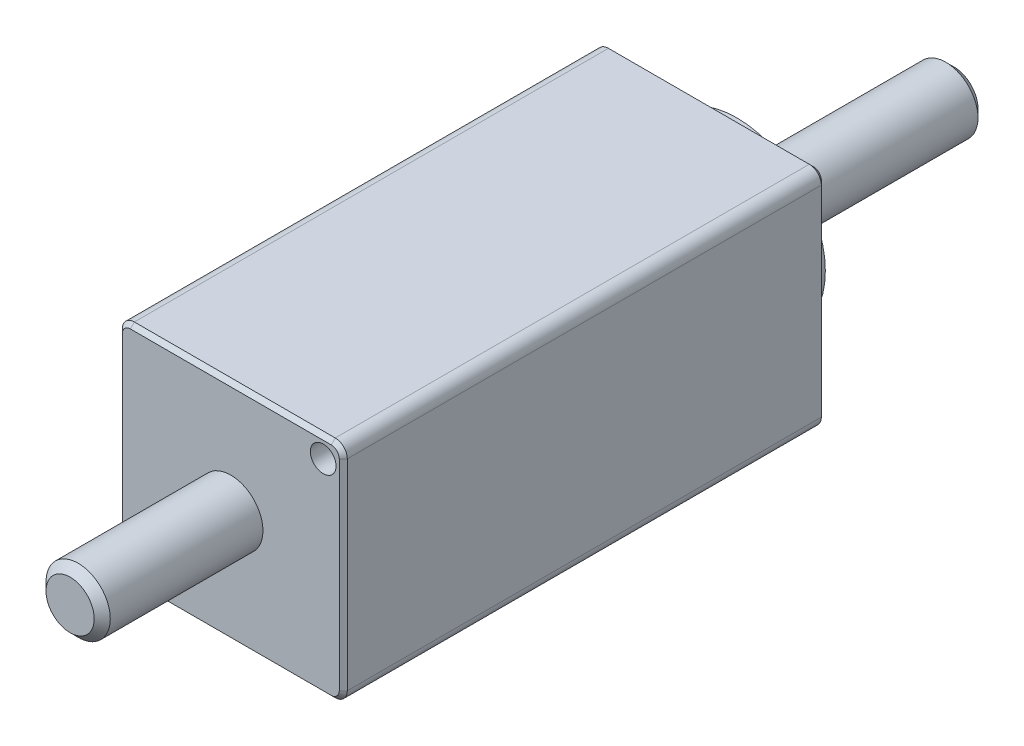
ISO-10303-21;
HEADER;
FILE_DESCRIPTION(('STEP AP214'),'2;1');
FILE_NAME('part.step','',(''),(''),'','','');
FILE_SCHEMA(('AUTOMOTIVE_DESIGN { 1 0 10303 214 1 1 1 1 }'));
ENDSEC;
DATA;
#1=APPLICATION_CONTEXT('core data for automotive mechanical design processes');
#2=APPLICATION_PROTOCOL_DEFINITION('international standard','automotive_design',2000,#1);
#3=PRODUCT_CONTEXT('',#1,'mechanical');
#4=PRODUCT('Part','Part','',(#3));
#5=PRODUCT_RELATED_PRODUCT_CATEGORY('part','',(#4));
#6=PRODUCT_DEFINITION_FORMATION('','',#4);
#7=PRODUCT_DEFINITION_CONTEXT('part definition',#1,'design');
#8=PRODUCT_DEFINITION('design','',#6,#7);
#9=PRODUCT_DEFINITION_SHAPE('','',#8);
#10=(LENGTH_UNIT() NAMED_UNIT(*) SI_UNIT(.MILLI.,.METRE.));
#11=(NAMED_UNIT(*) PLANE_ANGLE_UNIT() SI_UNIT($,.RADIAN.));
#12=(NAMED_UNIT(*) SI_UNIT($,.STERADIAN.) SOLID_ANGLE_UNIT());
#13=UNCERTAINTY_MEASURE_WITH_UNIT(LENGTH_MEASURE(1.E-05),#10,'distance_accuracy_value','');
#14=(GEOMETRIC_REPRESENTATION_CONTEXT(3) GLOBAL_UNCERTAINTY_ASSIGNED_CONTEXT((#13)) GLOBAL_UNIT_ASSIGNED_CONTEXT((#10,
#11,#12)) REPRESENTATION_CONTEXT('',''));
#15=CARTESIAN_POINT('',(0.,0.,0.));
#16=DIRECTION('',(0.,0.,1.));
#17=DIRECTION('',(1.,0.,0.));
#18=AXIS2_PLACEMENT_3D('',#15,#16,#17);
#19=CARTESIAN_POINT('',(7.,7.,30.));
#20=DIRECTION('',(-1.,0.,0.));
#21=DIRECTION('',(0.,-1.,0.));
#22=AXIS2_PLACEMENT_3D('',#19,#20,#21);
#23=PLANE('',#22);
#24=DIRECTION('',(0.,0.,-1.));
#25=VECTOR('',#24,1.);
#26=CARTESIAN_POINT('',(7.,6.25,30.));
#27=LINE('',#26,#25);
#28=CARTESIAN_POINT('',(7.,6.25,0.25));
#29=VERTEX_POINT('',#28);
#30=CARTESIAN_POINT('',(7.,6.25,29.75));
#31=VERTEX_POINT('',#30);
#32=EDGE_CURVE('E250',#29,#31,#27,.F.);
#33=ORIENTED_EDGE('',*,*,#32,.T.);
#34=DIRECTION('',(0.,-1.,0.));
#35=VECTOR('',#34,1.);
#36=CARTESIAN_POINT('',(7.,-6.25,29.75));
#37=LINE('',#36,#35);
#38=CARTESIAN_POINT('',(7.,-6.25,29.75));
#39=VERTEX_POINT('',#38);
#40=EDGE_CURVE('E285',#31,#39,#37,.T.);
#41=ORIENTED_EDGE('',*,*,#40,.T.);
#42=DIRECTION('',(0.,0.,-1.));
#43=VECTOR('',#42,1.);
#44=CARTESIAN_POINT('',(7.,-6.25,30.));
#45=LINE('',#44,#43);
#46=CARTESIAN_POINT('',(7.,-6.25,0.25));
#47=VERTEX_POINT('',#46);
#48=EDGE_CURVE('E247',#39,#47,#45,.T.);
#49=ORIENTED_EDGE('',*,*,#48,.T.);
#50=DIRECTION('',(0.,1.,0.));
#51=VECTOR('',#50,1.);
#52=CARTESIAN_POINT('',(7.,7.,0.25));
#53=LINE('',#52,#51);
#54=EDGE_CURVE('E282',#47,#29,#53,.T.);
#55=ORIENTED_EDGE('',*,*,#54,.T.);
#56=EDGE_LOOP('',(#33,#41,#49,#55));
#57=FACE_BOUND('',#56,.T.);
#58=ADVANCED_FACE('F39',(#57),#23,.F.);
#59=CARTESIAN_POINT('',(-7.,7.,30.));
#60=DIRECTION('',(0.,-1.,0.));
#61=DIRECTION('',(0.,0.,-1.));
#62=AXIS2_PLACEMENT_3D('',#59,#60,#61);
#63=PLANE('',#62);
#64=DIRECTION('',(0.,0.,-1.));
#65=VECTOR('',#64,1.);
#66=CARTESIAN_POINT('',(-6.25,7.,30.));
#67=LINE('',#66,#65);
#68=CARTESIAN_POINT('',(-6.25,7.,0.25));
#69=VERTEX_POINT('',#68);
#70=CARTESIAN_POINT('',(-6.25,7.,29.75));
#71=VERTEX_POINT('',#70);
#72=EDGE_CURVE('E241',#69,#71,#67,.F.);
#73=ORIENTED_EDGE('',*,*,#72,.T.);
#74=DIRECTION('',(1.,0.,0.));
#75=VECTOR('',#74,1.);
#76=CARTESIAN_POINT('',(6.25,7.,29.75));
#77=LINE('',#76,#75);
#78=CARTESIAN_POINT('',(6.25,7.,29.75));
#79=VERTEX_POINT('',#78);
#80=EDGE_CURVE('E298',#71,#79,#77,.T.);
#81=ORIENTED_EDGE('',*,*,#80,.T.);
#82=DIRECTION('',(0.,0.,-1.));
#83=VECTOR('',#82,1.);
#84=CARTESIAN_POINT('',(6.25,7.,30.));
#85=LINE('',#84,#83);
#86=CARTESIAN_POINT('',(6.25,7.,0.25));
#87=VERTEX_POINT('',#86);
#88=EDGE_CURVE('E244',#79,#87,#85,.T.);
#89=ORIENTED_EDGE('',*,*,#88,.T.);
#90=DIRECTION('',(-1.,0.,0.));
#91=VECTOR('',#90,1.);
#92=CARTESIAN_POINT('',(-7.,7.,0.25));
#93=LINE('',#92,#91);
#94=EDGE_CURVE('E296',#87,#69,#93,.T.);
#95=ORIENTED_EDGE('',*,*,#94,.T.);
#96=EDGE_LOOP('',(#73,#81,#89,#95));
#97=FACE_BOUND('',#96,.T.);
#98=ADVANCED_FACE('F450',(#97),#63,.F.);
#99=CARTESIAN_POINT('',(-7.,7.,30.));
#100=DIRECTION('',(1.,0.,0.));
#101=DIRECTION('',(0.,1.,0.));
#102=AXIS2_PLACEMENT_3D('',#99,#100,#101);
#103=PLANE('',#102);
#104=DIRECTION('',(0.,0.,-1.));
#105=VECTOR('',#104,1.);
#106=CARTESIAN_POINT('',(-7.,-6.25,30.));
#107=LINE('',#106,#105);
#108=CARTESIAN_POINT('',(-7.,-6.25,0.25));
#109=VERTEX_POINT('',#108);
#110=CARTESIAN_POINT('',(-7.,-6.25,29.75));
#111=VERTEX_POINT('',#110);
#112=EDGE_CURVE('E262',#109,#111,#107,.F.);
#113=ORIENTED_EDGE('',*,*,#112,.T.);
#114=DIRECTION('',(0.,1.,0.));
#115=VECTOR('',#114,1.);
#116=CARTESIAN_POINT('',(-7.,6.25,29.75));
#117=LINE('',#116,#115);
#118=CARTESIAN_POINT('',(-7.,6.25,29.75));
#119=VERTEX_POINT('',#118);
#120=EDGE_CURVE('E314',#111,#119,#117,.T.);
#121=ORIENTED_EDGE('',*,*,#120,.T.);
#122=DIRECTION('',(0.,0.,-1.));
#123=VECTOR('',#122,1.);
#124=CARTESIAN_POINT('',(-7.,6.25,30.));
#125=LINE('',#124,#123);
#126=CARTESIAN_POINT('',(-7.,6.25,0.25));
#127=VERTEX_POINT('',#126);
#128=EDGE_CURVE('E259',#119,#127,#125,.T.);
#129=ORIENTED_EDGE('',*,*,#128,.T.);
#130=DIRECTION('',(0.,-1.,0.));
#131=VECTOR('',#130,1.);
#132=CARTESIAN_POINT('',(-7.,7.,0.25));
#133=LINE('',#132,#131);
#134=EDGE_CURVE('E312',#127,#109,#133,.T.);
#135=ORIENTED_EDGE('',*,*,#134,.T.);
#136=EDGE_LOOP('',(#113,#121,#129,#135));
#137=FACE_BOUND('',#136,.T.);
#138=ADVANCED_FACE('F434',(#137),#103,.F.);
#139=CARTESIAN_POINT('',(-7.,-7.,30.));
#140=DIRECTION('',(0.,1.,0.));
#141=DIRECTION('',(0.,0.,1.));
#142=AXIS2_PLACEMENT_3D('',#139,#140,#141);
#143=PLANE('',#142);
#144=DIRECTION('',(0.,0.,-1.));
#145=VECTOR('',#144,1.);
#146=CARTESIAN_POINT('',(6.25,-7.,30.));
#147=LINE('',#146,#145);
#148=CARTESIAN_POINT('',(6.25,-7.,0.25));
#149=VERTEX_POINT('',#148);
#150=CARTESIAN_POINT('',(6.25,-7.,29.75));
#151=VERTEX_POINT('',#150);
#152=EDGE_CURVE('E256',#149,#151,#147,.F.);
#153=ORIENTED_EDGE('',*,*,#152,.T.);
#154=DIRECTION('',(-1.,0.,0.));
#155=VECTOR('',#154,1.);
#156=CARTESIAN_POINT('',(-6.25,-7.,29.75));
#157=LINE('',#156,#155);
#158=CARTESIAN_POINT('',(-6.25,-7.,29.75));
#159=VERTEX_POINT('',#158);
#160=EDGE_CURVE('E302',#151,#159,#157,.T.);
#161=ORIENTED_EDGE('',*,*,#160,.T.);
#162=DIRECTION('',(0.,0.,-1.));
#163=VECTOR('',#162,1.);
#164=CARTESIAN_POINT('',(-6.25,-7.,30.));
#165=LINE('',#164,#163);
#166=CARTESIAN_POINT('',(-6.25,-7.,0.25));
#167=VERTEX_POINT('',#166);
#168=EDGE_CURVE('E253',#159,#167,#165,.T.);
#169=ORIENTED_EDGE('',*,*,#168,.T.);
#170=DIRECTION('',(1.,0.,0.));
#171=VECTOR('',#170,1.);
#172=CARTESIAN_POINT('',(-7.,-7.,0.25));
#173=LINE('',#172,#171);
#174=EDGE_CURVE('E300',#167,#149,#173,.T.);
#175=ORIENTED_EDGE('',*,*,#174,.T.);
#176=EDGE_LOOP('',(#153,#161,#169,#175));
#177=FACE_BOUND('',#176,.T.);
#178=ADVANCED_FACE('F419',(#177),#143,.F.);
#179=CARTESIAN_POINT('',(0.,0.,30.));
#180=DIRECTION('',(0.,0.,1.));
#181=DIRECTION('',(1.,0.,0.));
#182=AXIS2_PLACEMENT_3D('',#179,#180,#181);
#183=PLANE('',#182);
#184=CARTESIAN_POINT('',(5.75,5.75,30.));
#185=DIRECTION('',(0.,0.,1.));
#186=DIRECTION('',(1.,0.,0.));
#187=AXIS2_PLACEMENT_3D('',#184,#185,#186);
#188=CIRCLE('',#187,0.79999999999999);
#189=CARTESIAN_POINT('',(6.54999999999999,5.75,30.));
#190=VERTEX_POINT('',#189);
#191=EDGE_CURVE('E181',#190,#190,#188,.T.);
#192=ORIENTED_EDGE('',*,*,#191,.F.);
#193=EDGE_LOOP('',(#192));
#194=FACE_BOUND('',#193,.T.);
#195=CARTESIAN_POINT('',(-5.75,-5.75,30.));
#196=DIRECTION('',(0.,0.,1.));
#197=DIRECTION('',(1.,0.,0.));
#198=AXIS2_PLACEMENT_3D('',#195,#196,#197);
#199=CIRCLE('',#198,0.79999999999999);
#200=CARTESIAN_POINT('',(-4.95000000000001,-5.75,30.));
#201=VERTEX_POINT('',#200);
#202=EDGE_CURVE('E180',#201,#201,#199,.T.);
#203=ORIENTED_EDGE('',*,*,#202,.F.);
#204=EDGE_LOOP('',(#203));
#205=FACE_BOUND('',#204,.T.);
#206=CARTESIAN_POINT('',(6.25,-6.25,30.));
#207=DIRECTION('',(0.,0.,1.));
#208=DIRECTION('',(1.,0.,0.));
#209=AXIS2_PLACEMENT_3D('',#206,#207,#208);
#210=CIRCLE('',#209,0.5);
#211=CARTESIAN_POINT('',(6.25,-6.75,30.));
#212=VERTEX_POINT('',#211);
#213=CARTESIAN_POINT('',(6.75,-6.25,30.));
#214=VERTEX_POINT('',#213);
#215=EDGE_CURVE('E275',#212,#214,#210,.T.);
#216=ORIENTED_EDGE('',*,*,#215,.T.);
#217=DIRECTION('',(0.,1.,0.));
#218=VECTOR('',#217,1.);
#219=CARTESIAN_POINT('',(6.75,6.25,30.));
#220=LINE('',#219,#218);
#221=CARTESIAN_POINT('',(6.75,6.25,30.));
#222=VERTEX_POINT('',#221);
#223=EDGE_CURVE('E279',#214,#222,#220,.T.);
#224=ORIENTED_EDGE('',*,*,#223,.T.);
#225=CARTESIAN_POINT('',(6.25,6.25,30.));
#226=DIRECTION('',(0.,0.,1.));
#227=DIRECTION('',(1.,0.,0.));
#228=AXIS2_PLACEMENT_3D('',#225,#226,#227);
#229=CIRCLE('',#228,0.5);
#230=CARTESIAN_POINT('',(6.25,6.75,30.));
#231=VERTEX_POINT('',#230);
#232=EDGE_CURVE('E277',#222,#231,#229,.T.);
#233=ORIENTED_EDGE('',*,*,#232,.T.);
#234=DIRECTION('',(-1.,0.,0.));
#235=VECTOR('',#234,1.);
#236=CARTESIAN_POINT('',(-6.25,6.75,30.));
#237=LINE('',#236,#235);
#238=CARTESIAN_POINT('',(-6.25,6.75,30.));
#239=VERTEX_POINT('',#238);
#240=EDGE_CURVE('E273',#231,#239,#237,.T.);
#241=ORIENTED_EDGE('',*,*,#240,.T.);
#242=CARTESIAN_POINT('',(-6.25,6.25,30.));
#243=DIRECTION('',(0.,0.,1.));
#244=DIRECTION('',(1.,0.,0.));
#245=AXIS2_PLACEMENT_3D('',#242,#243,#244);
#246=CIRCLE('',#245,0.5);
#247=CARTESIAN_POINT('',(-6.75,6.25,30.));
#248=VERTEX_POINT('',#247);
#249=EDGE_CURVE('E269',#239,#248,#246,.T.);
#250=ORIENTED_EDGE('',*,*,#249,.T.);
#251=DIRECTION('',(0.,-1.,0.));
#252=VECTOR('',#251,1.);
#253=CARTESIAN_POINT('',(-6.75,-6.25,30.));
#254=LINE('',#253,#252);
#255=CARTESIAN_POINT('',(-6.75,-6.25,30.));
#256=VERTEX_POINT('',#255);
#257=EDGE_CURVE('E265',#248,#256,#254,.T.);
#258=ORIENTED_EDGE('',*,*,#257,.T.);
#259=CARTESIAN_POINT('',(-6.25,-6.25,30.));
#260=DIRECTION('',(0.,0.,1.));
#261=DIRECTION('',(1.,0.,0.));
#262=AXIS2_PLACEMENT_3D('',#259,#260,#261);
#263=CIRCLE('',#262,0.5);
#264=CARTESIAN_POINT('',(-6.25,-6.75,30.));
#265=VERTEX_POINT('',#264);
#266=EDGE_CURVE('E267',#256,#265,#263,.T.);
#267=ORIENTED_EDGE('',*,*,#266,.T.);
#268=DIRECTION('',(1.,0.,0.));
#269=VECTOR('',#268,1.);
#270=CARTESIAN_POINT('',(6.25,-6.75,30.));
#271=LINE('',#270,#269);
#272=EDGE_CURVE('E271',#265,#212,#271,.T.);
#273=ORIENTED_EDGE('',*,*,#272,.T.);
#274=EDGE_LOOP('',(#216,#224,#233,#241,#250,#258,#267,#273));
#275=FACE_BOUND('',#274,.T.);
#276=CARTESIAN_POINT('',(0.,0.,30.));
#277=DIRECTION('',(0.,0.,1.));
#278=DIRECTION('',(1.,0.,0.));
#279=AXIS2_PLACEMENT_3D('',#276,#277,#278);
#280=CIRCLE('',#279,2.);
#281=CARTESIAN_POINT('',(2.,0.,30.));
#282=VERTEX_POINT('',#281);
#283=EDGE_CURVE('E217',#282,#282,#280,.T.);
#284=ORIENTED_EDGE('',*,*,#283,.F.);
#285=EDGE_LOOP('',(#284));
#286=FACE_BOUND('',#285,.T.);
#287=ADVANCED_FACE('F410',(#194,#205,#275,#286),#183,.T.);
#288=CARTESIAN_POINT('',(0.,0.,0.));
#289=DIRECTION('',(0.,0.,1.));
#290=DIRECTION('',(1.,0.,0.));
#291=AXIS2_PLACEMENT_3D('',#288,#289,#290);
#292=PLANE('',#291);
#293=CARTESIAN_POINT('',(6.25,6.25,0.));
#294=DIRECTION('',(0.,0.,1.));
#295=DIRECTION('',(1.,0.,0.));
#296=AXIS2_PLACEMENT_3D('',#293,#294,#295);
#297=CIRCLE('',#296,0.499999999999993);
#298=CARTESIAN_POINT('',(6.25,6.74999999999999,0.));
#299=VERTEX_POINT('',#298);
#300=CARTESIAN_POINT('',(6.74999999999999,6.25,0.));
#301=VERTEX_POINT('',#300);
#302=EDGE_CURVE('E48',#299,#301,#297,.F.);
#303=ORIENTED_EDGE('',*,*,#302,.T.);
#304=DIRECTION('',(0.,-1.,0.));
#305=VECTOR('',#304,1.);
#306=CARTESIAN_POINT('',(6.74999999999999,0.,0.));
#307=LINE('',#306,#305);
#308=CARTESIAN_POINT('',(6.74999999999999,-6.25,0.));
#309=VERTEX_POINT('',#308);
#310=EDGE_CURVE('E12',#301,#309,#307,.T.);
#311=ORIENTED_EDGE('',*,*,#310,.T.);
#312=CARTESIAN_POINT('',(6.25,-6.25,0.));
#313=DIRECTION('',(0.,0.,1.));
#314=DIRECTION('',(1.,0.,0.));
#315=AXIS2_PLACEMENT_3D('',#312,#313,#314);
#316=CIRCLE('',#315,0.499999999999993);
#317=CARTESIAN_POINT('',(6.25,-6.74999999999999,0.));
#318=VERTEX_POINT('',#317);
#319=EDGE_CURVE('E326',#309,#318,#316,.F.);
#320=ORIENTED_EDGE('',*,*,#319,.T.);
#321=DIRECTION('',(-1.,0.,0.));
#322=VECTOR('',#321,1.);
#323=CARTESIAN_POINT('',(0.,-6.74999999999999,0.));
#324=LINE('',#323,#322);
#325=CARTESIAN_POINT('',(-6.25,-6.74999999999999,0.));
#326=VERTEX_POINT('',#325);
#327=EDGE_CURVE('E322',#318,#326,#324,.T.);
#328=ORIENTED_EDGE('',*,*,#327,.T.);
#329=CARTESIAN_POINT('',(-6.25,-6.25,0.));
#330=DIRECTION('',(0.,0.,1.));
#331=DIRECTION('',(1.,0.,0.));
#332=AXIS2_PLACEMENT_3D('',#329,#330,#331);
#333=CIRCLE('',#332,0.499999999999993);
#334=CARTESIAN_POINT('',(-6.74999999999999,-6.25,0.));
#335=VERTEX_POINT('',#334);
#336=EDGE_CURVE('E318',#326,#335,#333,.F.);
#337=ORIENTED_EDGE('',*,*,#336,.T.);
#338=DIRECTION('',(0.,1.,0.));
#339=VECTOR('',#338,1.);
#340=CARTESIAN_POINT('',(-6.74999999999999,0.,0.));
#341=LINE('',#340,#339);
#342=CARTESIAN_POINT('',(-6.74999999999999,6.25,0.));
#343=VERTEX_POINT('',#342);
#344=EDGE_CURVE('E316',#335,#343,#341,.T.);
#345=ORIENTED_EDGE('',*,*,#344,.T.);
#346=CARTESIAN_POINT('',(-6.25,6.25,0.));
#347=DIRECTION('',(0.,0.,1.));
#348=DIRECTION('',(1.,0.,0.));
#349=AXIS2_PLACEMENT_3D('',#346,#347,#348);
#350=CIRCLE('',#349,0.499999999999993);
#351=CARTESIAN_POINT('',(-6.25,6.74999999999999,0.));
#352=VERTEX_POINT('',#351);
#353=EDGE_CURVE('E320',#343,#352,#350,.F.);
#354=ORIENTED_EDGE('',*,*,#353,.T.);
#355=DIRECTION('',(1.,0.,0.));
#356=VECTOR('',#355,1.);
#357=CARTESIAN_POINT('',(0.,6.74999999999999,0.));
#358=LINE('',#357,#356);
#359=EDGE_CURVE('E324',#352,#299,#358,.T.);
#360=ORIENTED_EDGE('',*,*,#359,.T.);
#361=EDGE_LOOP('',(#303,#311,#320,#328,#337,#345,#354,#360));
#362=FACE_BOUND('',#361,.T.);
#363=CARTESIAN_POINT('',(-5.75,5.75,0.));
#364=DIRECTION('',(0.,0.,-1.));
#365=DIRECTION('',(-1.,0.,0.));
#366=AXIS2_PLACEMENT_3D('',#363,#364,#365);
#367=CIRCLE('',#366,0.79999999999999);
#368=CARTESIAN_POINT('',(-6.54999999999999,5.75,0.));
#369=VERTEX_POINT('',#368);
#370=EDGE_CURVE('E192',#369,#369,#367,.T.);
#371=ORIENTED_EDGE('',*,*,#370,.F.);
#372=EDGE_LOOP('',(#371));
#373=FACE_BOUND('',#372,.T.);
#374=CARTESIAN_POINT('',(5.75,5.75,0.));
#375=DIRECTION('',(0.,0.,-1.));
#376=DIRECTION('',(-1.,0.,0.));
#377=AXIS2_PLACEMENT_3D('',#374,#375,#376);
#378=CIRCLE('',#377,0.79999999999999);
#379=CARTESIAN_POINT('',(4.95000000000001,5.75,0.));
#380=VERTEX_POINT('',#379);
#381=EDGE_CURVE('E199',#380,#380,#378,.T.);
#382=ORIENTED_EDGE('',*,*,#381,.F.);
#383=EDGE_LOOP('',(#382));
#384=FACE_BOUND('',#383,.T.);
#385=CARTESIAN_POINT('',(5.75,-5.75,0.));
#386=DIRECTION('',(0.,0.,-1.));
#387=DIRECTION('',(-1.,0.,0.));
#388=AXIS2_PLACEMENT_3D('',#385,#386,#387);
#389=CIRCLE('',#388,0.79999999999999);
#390=CARTESIAN_POINT('',(4.95000000000001,-5.75,0.));
#391=VERTEX_POINT('',#390);
#392=EDGE_CURVE('E205',#391,#391,#389,.T.);
#393=ORIENTED_EDGE('',*,*,#392,.F.);
#394=EDGE_LOOP('',(#393));
#395=FACE_BOUND('',#394,.T.);
#396=CARTESIAN_POINT('',(-5.75,-5.75,0.));
#397=DIRECTION('',(0.,0.,-1.));
#398=DIRECTION('',(-1.,0.,0.));
#399=AXIS2_PLACEMENT_3D('',#396,#397,#398);
#400=CIRCLE('',#399,0.79999999999999);
#401=CARTESIAN_POINT('',(-6.54999999999999,-5.75,0.));
#402=VERTEX_POINT('',#401);
#403=EDGE_CURVE('E211',#402,#402,#400,.T.);
#404=ORIENTED_EDGE('',*,*,#403,.F.);
#405=EDGE_LOOP('',(#404));
#406=FACE_BOUND('',#405,.T.);
#407=CARTESIAN_POINT('',(0.,0.,0.));
#408=DIRECTION('',(0.,0.,1.));
#409=DIRECTION('',(1.,0.,0.));
#410=AXIS2_PLACEMENT_3D('',#407,#408,#409);
#411=CIRCLE('',#410,5.5);
#412=CARTESIAN_POINT('',(5.5,0.,0.));
#413=VERTEX_POINT('',#412);
#414=EDGE_CURVE('E226',#413,#413,#411,.F.);
#415=ORIENTED_EDGE('',*,*,#414,.F.);
#416=EDGE_LOOP('',(#415));
#417=FACE_BOUND('',#416,.T.);
#418=ADVANCED_FACE('F379',(#362,#373,#384,#395,#406,#417),#292,.F.);
#419=CARTESIAN_POINT('',(0.,0.,-1.5));
#420=DIRECTION('',(0.,0.,1.));
#421=DIRECTION('',(1.,0.,0.));
#422=AXIS2_PLACEMENT_3D('',#419,#420,#421);
#423=CYLINDRICAL_SURFACE('',#422,5.5);
#424=CARTESIAN_POINT('',(0.,0.,-1.5));
#425=DIRECTION('',(0.,0.,-1.));
#426=DIRECTION('',(-1.,0.,0.));
#427=AXIS2_PLACEMENT_3D('',#424,#425,#426);
#428=CIRCLE('',#427,5.5);
#429=CARTESIAN_POINT('',(-5.5,0.,-1.5));
#430=VERTEX_POINT('',#429);
#431=EDGE_CURVE('E223',#430,#430,#428,.T.);
#432=ORIENTED_EDGE('',*,*,#431,.F.);
#433=EDGE_LOOP('',(#432));
#434=FACE_BOUND('',#433,.T.);
#435=ORIENTED_EDGE('',*,*,#414,.T.);
#436=EDGE_LOOP('',(#435));
#437=FACE_BOUND('',#436,.T.);
#438=ADVANCED_FACE('F733',(#434,#437),#423,.T.);
#439=CARTESIAN_POINT('',(0.,0.,-1.5));
#440=DIRECTION('',(0.,0.,-1.));
#441=DIRECTION('',(-1.,0.,0.));
#442=AXIS2_PLACEMENT_3D('',#439,#440,#441);
#443=PLANE('',#442);
#444=CARTESIAN_POINT('',(0.,0.,-1.5));
#445=DIRECTION('',(0.,0.,-1.));
#446=DIRECTION('',(-1.,0.,0.));
#447=AXIS2_PLACEMENT_3D('',#444,#445,#446);
#448=CIRCLE('',#447,2.);
#449=CARTESIAN_POINT('',(-2.,0.,-1.5));
#450=VERTEX_POINT('',#449);
#451=EDGE_CURVE('E220',#450,#450,#448,.T.);
#452=ORIENTED_EDGE('',*,*,#451,.F.);
#453=EDGE_LOOP('',(#452));
#454=FACE_BOUND('',#453,.T.);
#455=ORIENTED_EDGE('',*,*,#431,.T.);
#456=EDGE_LOOP('',(#455));
#457=FACE_BOUND('',#456,.T.);
#458=ADVANCED_FACE('F740',(#454,#457),#443,.T.);
#459=CARTESIAN_POINT('',(0.,0.,-35.6568542494924));
#460=DIRECTION('',(0.,0.,1.));
#461=DIRECTION('',(1.,0.,0.));
#462=AXIS2_PLACEMENT_3D('',#459,#460,#461);
#463=CYLINDRICAL_SURFACE('',#462,2.);
#464=CARTESIAN_POINT('',(0.,0.,-14.5));
#465=DIRECTION('',(0.,0.,1.));
#466=DIRECTION('',(1.,0.,0.));
#467=AXIS2_PLACEMENT_3D('',#464,#465,#466);
#468=CIRCLE('',#467,2.);
#469=CARTESIAN_POINT('',(2.,0.,-14.5));
#470=VERTEX_POINT('',#469);
#471=EDGE_CURVE('E235',#470,#470,#468,.T.);
#472=ORIENTED_EDGE('',*,*,#471,.T.);
#473=EDGE_LOOP('',(#472));
#474=FACE_BOUND('',#473,.T.);
#475=ORIENTED_EDGE('',*,*,#451,.T.);
#476=EDGE_LOOP('',(#475));
#477=FACE_BOUND('',#476,.T.);
#478=ADVANCED_FACE('F748',(#474,#477),#463,.T.);
#479=CARTESIAN_POINT('',(0.,0.,-15.));
#480=DIRECTION('',(0.,0.,1.));
#481=DIRECTION('',(1.,0.,0.));
#482=AXIS2_PLACEMENT_3D('',#479,#480,#481);
#483=PLANE('',#482);
#484=CARTESIAN_POINT('',(0.,0.,-15.));
#485=DIRECTION('',(0.,0.,1.));
#486=DIRECTION('',(1.,0.,0.));
#487=AXIS2_PLACEMENT_3D('',#484,#485,#486);
#488=CIRCLE('',#487,1.5);
#489=CARTESIAN_POINT('',(1.5,0.,-15.));
#490=VERTEX_POINT('',#489);
#491=EDGE_CURVE('E238',#490,#490,#488,.F.);
#492=ORIENTED_EDGE('',*,*,#491,.T.);
#493=EDGE_LOOP('',(#492));
#494=FACE_BOUND('',#493,.T.);
#495=ADVANCED_FACE('F755',(#494),#483,.F.);
#496=CARTESIAN_POINT('',(0.,0.,40.));
#497=DIRECTION('',(0.,0.,-1.));
#498=DIRECTION('',(-1.,0.,0.));
#499=AXIS2_PLACEMENT_3D('',#496,#497,#498);
#500=CYLINDRICAL_SURFACE('',#499,2.);
#501=CARTESIAN_POINT('',(0.,0.,39.5));
#502=DIRECTION('',(0.,0.,1.));
#503=DIRECTION('',(1.,0.,0.));
#504=AXIS2_PLACEMENT_3D('',#501,#502,#503);
#505=CIRCLE('',#504,2.);
#506=CARTESIAN_POINT('',(2.,0.,39.5));
#507=VERTEX_POINT('',#506);
#508=EDGE_CURVE('E232',#507,#507,#505,.F.);
#509=ORIENTED_EDGE('',*,*,#508,.T.);
#510=EDGE_LOOP('',(#509));
#511=FACE_BOUND('',#510,.T.);
#512=ORIENTED_EDGE('',*,*,#283,.T.);
#513=EDGE_LOOP('',(#512));
#514=FACE_BOUND('',#513,.T.);
#515=ADVANCED_FACE('F763',(#511,#514),#500,.T.);
#516=CARTESIAN_POINT('',(0.,0.,40.));
#517=DIRECTION('',(0.,0.,1.));
#518=DIRECTION('',(1.,0.,0.));
#519=AXIS2_PLACEMENT_3D('',#516,#517,#518);
#520=PLANE('',#519);
#521=CARTESIAN_POINT('',(0.,0.,40.));
#522=DIRECTION('',(0.,0.,1.));
#523=DIRECTION('',(1.,0.,0.));
#524=AXIS2_PLACEMENT_3D('',#521,#522,#523);
#525=CIRCLE('',#524,1.5);
#526=CARTESIAN_POINT('',(1.5,0.,40.));
#527=VERTEX_POINT('',#526);
#528=EDGE_CURVE('E229',#527,#527,#525,.T.);
#529=ORIENTED_EDGE('',*,*,#528,.T.);
#530=EDGE_LOOP('',(#529));
#531=FACE_BOUND('',#530,.T.);
#532=ADVANCED_FACE('F485',(#531),#520,.T.);
#533=CARTESIAN_POINT('',(0.,0.,40.));
#534=DIRECTION('',(0.,0.,-1.));
#535=DIRECTION('',(-1.,0.,0.));
#536=AXIS2_PLACEMENT_3D('',#533,#534,#535);
#537=CONICAL_SURFACE('',#536,1.5,0.785398163397447);
#538=ORIENTED_EDGE('',*,*,#508,.F.);
#539=EDGE_LOOP('',(#538));
#540=FACE_BOUND('',#539,.T.);
#541=ORIENTED_EDGE('',*,*,#528,.F.);
#542=EDGE_LOOP('',(#541));
#543=FACE_BOUND('',#542,.T.);
#544=ADVANCED_FACE('F481',(#540,#543),#537,.T.);
#545=CARTESIAN_POINT('',(0.,0.,-14.5));
#546=DIRECTION('',(0.,0.,1.));
#547=DIRECTION('',(1.,0.,0.));
#548=AXIS2_PLACEMENT_3D('',#545,#546,#547);
#549=CONICAL_SURFACE('',#548,2.,0.785398163397453);
#550=ORIENTED_EDGE('',*,*,#491,.F.);
#551=EDGE_LOOP('',(#550));
#552=FACE_BOUND('',#551,.T.);
#553=ORIENTED_EDGE('',*,*,#471,.F.);
#554=EDGE_LOOP('',(#553));
#555=FACE_BOUND('',#554,.T.);
#556=ADVANCED_FACE('F484',(#552,#555),#549,.T.);
#557=CARTESIAN_POINT('',(-5.75,-5.75,4.4));
#558=DIRECTION('',(0.,0.,-1.));
#559=DIRECTION('',(-1.,0.,0.));
#560=AXIS2_PLACEMENT_3D('',#557,#558,#559);
#561=CONICAL_SURFACE('',#560,0.799999999999999,1.02974425867665);
#562=CARTESIAN_POINT('',(-5.75,-5.75,4.88068849522205));
#563=VERTEX_POINT('',#562);
#564=VERTEX_LOOP('',#563);
#565=FACE_BOUND('',#564,.T.);
#566=CARTESIAN_POINT('',(-5.75,-5.75,4.4));
#567=DIRECTION('',(0.,0.,-1.));
#568=DIRECTION('',(-1.,0.,0.));
#569=AXIS2_PLACEMENT_3D('',#566,#567,#568);
#570=CIRCLE('',#569,0.799999999999999);
#571=CARTESIAN_POINT('',(-6.55,-5.75,4.4));
#572=VERTEX_POINT('',#571);
#573=EDGE_CURVE('E214',#572,#572,#570,.T.);
#574=ORIENTED_EDGE('',*,*,#573,.T.);
#575=EDGE_LOOP('',(#574));
#576=FACE_BOUND('',#575,.T.);
#577=ADVANCED_FACE('F489',(#565,#576),#561,.F.);
#578=CARTESIAN_POINT('',(-5.75,-5.75,0.));
#579=DIRECTION('',(0.,0.,-1.));
#580=DIRECTION('',(-1.,0.,0.));
#581=AXIS2_PLACEMENT_3D('',#578,#579,#580);
#582=CYLINDRICAL_SURFACE('',#581,0.799999999999994);
#583=ORIENTED_EDGE('',*,*,#573,.F.);
#584=EDGE_LOOP('',(#583));
#585=FACE_BOUND('',#584,.T.);
#586=ORIENTED_EDGE('',*,*,#403,.T.);
#587=EDGE_LOOP('',(#586));
#588=FACE_BOUND('',#587,.T.);
#589=ADVANCED_FACE('F649',(#585,#588),#582,.F.);
#590=CARTESIAN_POINT('',(5.75,-5.75,4.4));
#591=DIRECTION('',(0.,0.,-1.));
#592=DIRECTION('',(-1.,0.,0.));
#593=AXIS2_PLACEMENT_3D('',#590,#591,#592);
#594=CONICAL_SURFACE('',#593,0.799999999999999,1.02974425867665);
#595=CARTESIAN_POINT('',(5.75,-5.75,4.88068849522205));
#596=VERTEX_POINT('',#595);
#597=VERTEX_LOOP('',#596);
#598=FACE_BOUND('',#597,.T.);
#599=CARTESIAN_POINT('',(5.75,-5.75,4.4));
#600=DIRECTION('',(0.,0.,-1.));
#601=DIRECTION('',(-1.,0.,0.));
#602=AXIS2_PLACEMENT_3D('',#599,#600,#601);
#603=CIRCLE('',#602,0.799999999999999);
#604=CARTESIAN_POINT('',(4.95,-5.75,4.4));
#605=VERTEX_POINT('',#604);
#606=EDGE_CURVE('E208',#605,#605,#603,.T.);
#607=ORIENTED_EDGE('',*,*,#606,.T.);
#608=EDGE_LOOP('',(#607));
#609=FACE_BOUND('',#608,.T.);
#610=ADVANCED_FACE('F655',(#598,#609),#594,.F.);
#611=CARTESIAN_POINT('',(5.75,-5.75,0.));
#612=DIRECTION('',(0.,0.,-1.));
#613=DIRECTION('',(-1.,0.,0.));
#614=AXIS2_PLACEMENT_3D('',#611,#612,#613);
#615=CYLINDRICAL_SURFACE('',#614,0.799999999999994);
#616=ORIENTED_EDGE('',*,*,#606,.F.);
#617=EDGE_LOOP('',(#616));
#618=FACE_BOUND('',#617,.T.);
#619=ORIENTED_EDGE('',*,*,#392,.T.);
#620=EDGE_LOOP('',(#619));
#621=FACE_BOUND('',#620,.T.);
#622=ADVANCED_FACE('F664',(#618,#621),#615,.F.);
#623=CARTESIAN_POINT('',(5.75,5.75,4.4));
#624=DIRECTION('',(0.,0.,-1.));
#625=DIRECTION('',(-1.,0.,0.));
#626=AXIS2_PLACEMENT_3D('',#623,#624,#625);
#627=CONICAL_SURFACE('',#626,0.799999999999999,1.02974425867665);
#628=CARTESIAN_POINT('',(5.75,5.75,4.88068849522205));
#629=VERTEX_POINT('',#628);
#630=VERTEX_LOOP('',#629);
#631=FACE_BOUND('',#630,.T.);
#632=CARTESIAN_POINT('',(5.75,5.75,4.4));
#633=DIRECTION('',(0.,0.,-1.));
#634=DIRECTION('',(-1.,0.,0.));
#635=AXIS2_PLACEMENT_3D('',#632,#633,#634);
#636=CIRCLE('',#635,0.799999999999999);
#637=CARTESIAN_POINT('',(4.95,5.75,4.4));
#638=VERTEX_POINT('',#637);
#639=EDGE_CURVE('E202',#638,#638,#636,.T.);
#640=ORIENTED_EDGE('',*,*,#639,.T.);
#641=EDGE_LOOP('',(#640));
#642=FACE_BOUND('',#641,.T.);
#643=ADVANCED_FACE('F669',(#631,#642),#627,.F.);
#644=CARTESIAN_POINT('',(5.75,5.75,0.));
#645=DIRECTION('',(0.,0.,-1.));
#646=DIRECTION('',(-1.,0.,0.));
#647=AXIS2_PLACEMENT_3D('',#644,#645,#646);
#648=CYLINDRICAL_SURFACE('',#647,0.799999999999994);
#649=ORIENTED_EDGE('',*,*,#639,.F.);
#650=EDGE_LOOP('',(#649));
#651=FACE_BOUND('',#650,.T.);
#652=ORIENTED_EDGE('',*,*,#381,.T.);
#653=EDGE_LOOP('',(#652));
#654=FACE_BOUND('',#653,.T.);
#655=ADVANCED_FACE('F677',(#651,#654),#648,.F.);
#656=CARTESIAN_POINT('',(-5.75,5.75,4.4));
#657=DIRECTION('',(0.,0.,-1.));
#658=DIRECTION('',(-1.,0.,0.));
#659=AXIS2_PLACEMENT_3D('',#656,#657,#658);
#660=CONICAL_SURFACE('',#659,0.799999999999999,1.02974425867665);
#661=CARTESIAN_POINT('',(-5.75,5.75,4.88068849522205));
#662=VERTEX_POINT('',#661);
#663=VERTEX_LOOP('',#662);
#664=FACE_BOUND('',#663,.T.);
#665=CARTESIAN_POINT('',(-5.75,5.75,4.4));
#666=DIRECTION('',(0.,0.,-1.));
#667=DIRECTION('',(-1.,0.,0.));
#668=AXIS2_PLACEMENT_3D('',#665,#666,#667);
#669=CIRCLE('',#668,0.799999999999999);
#670=CARTESIAN_POINT('',(-6.55,5.75,4.4));
#671=VERTEX_POINT('',#670);
#672=EDGE_CURVE('E195',#671,#671,#669,.T.);
#673=ORIENTED_EDGE('',*,*,#672,.T.);
#674=EDGE_LOOP('',(#673));
#675=FACE_BOUND('',#674,.T.);
#676=ADVANCED_FACE('F682',(#664,#675),#660,.F.);
#677=CARTESIAN_POINT('',(-5.75,5.75,0.));
#678=DIRECTION('',(0.,0.,-1.));
#679=DIRECTION('',(-1.,0.,0.));
#680=AXIS2_PLACEMENT_3D('',#677,#678,#679);
#681=CYLINDRICAL_SURFACE('',#680,0.799999999999994);
#682=ORIENTED_EDGE('',*,*,#672,.F.);
#683=EDGE_LOOP('',(#682));
#684=FACE_BOUND('',#683,.T.);
#685=ORIENTED_EDGE('',*,*,#370,.T.);
#686=EDGE_LOOP('',(#685));
#687=FACE_BOUND('',#686,.T.);
#688=ADVANCED_FACE('F494',(#684,#687),#681,.F.);
#689=CARTESIAN_POINT('',(6.25,6.25,30.));
#690=DIRECTION('',(0.,0.,-1.));
#691=DIRECTION('',(-1.,0.,0.));
#692=AXIS2_PLACEMENT_3D('',#689,#690,#691);
#693=CYLINDRICAL_SURFACE('',#692,0.75);
#694=ORIENTED_EDGE('',*,*,#88,.F.);
#695=CARTESIAN_POINT('',(6.25,6.25,29.75));
#696=DIRECTION('',(0.,0.,1.));
#697=DIRECTION('',(1.,0.,0.));
#698=AXIS2_PLACEMENT_3D('',#695,#696,#697);
#699=CIRCLE('',#698,0.75);
#700=EDGE_CURVE('E290',#79,#31,#699,.F.);
#701=ORIENTED_EDGE('',*,*,#700,.T.);
#702=ORIENTED_EDGE('',*,*,#32,.F.);
#703=CARTESIAN_POINT('',(6.25,6.25,0.25));
#704=DIRECTION('',(0.,0.,1.));
#705=DIRECTION('',(1.,0.,0.));
#706=AXIS2_PLACEMENT_3D('',#703,#704,#705);
#707=CIRCLE('',#706,0.75);
#708=EDGE_CURVE('E288',#29,#87,#707,.T.);
#709=ORIENTED_EDGE('',*,*,#708,.T.);
#710=EDGE_LOOP('',(#694,#701,#702,#709));
#711=FACE_BOUND('',#710,.T.);
#712=ADVANCED_FACE('F491',(#711),#693,.T.);
#713=CARTESIAN_POINT('',(6.25,-6.25,30.));
#714=DIRECTION('',(0.,0.,-1.));
#715=DIRECTION('',(-1.,0.,0.));
#716=AXIS2_PLACEMENT_3D('',#713,#714,#715);
#717=CYLINDRICAL_SURFACE('',#716,0.75);
#718=ORIENTED_EDGE('',*,*,#48,.F.);
#719=CARTESIAN_POINT('',(6.25,-6.25,29.75));
#720=DIRECTION('',(0.,0.,1.));
#721=DIRECTION('',(1.,0.,0.));
#722=AXIS2_PLACEMENT_3D('',#719,#720,#721);
#723=CIRCLE('',#722,0.75);
#724=EDGE_CURVE('E294',#39,#151,#723,.F.);
#725=ORIENTED_EDGE('',*,*,#724,.T.);
#726=ORIENTED_EDGE('',*,*,#152,.F.);
#727=CARTESIAN_POINT('',(6.25,-6.25,0.25));
#728=DIRECTION('',(0.,0.,1.));
#729=DIRECTION('',(1.,0.,0.));
#730=AXIS2_PLACEMENT_3D('',#727,#728,#729);
#731=CIRCLE('',#730,0.75);
#732=EDGE_CURVE('E292',#149,#47,#731,.T.);
#733=ORIENTED_EDGE('',*,*,#732,.T.);
#734=EDGE_LOOP('',(#718,#725,#726,#733));
#735=FACE_BOUND('',#734,.T.);
#736=ADVANCED_FACE('F393',(#735),#717,.T.);
#737=CARTESIAN_POINT('',(-6.25,-6.25,30.));
#738=DIRECTION('',(0.,0.,-1.));
#739=DIRECTION('',(-1.,0.,0.));
#740=AXIS2_PLACEMENT_3D('',#737,#738,#739);
#741=CYLINDRICAL_SURFACE('',#740,0.75);
#742=ORIENTED_EDGE('',*,*,#168,.F.);
#743=CARTESIAN_POINT('',(-6.25,-6.25,29.75));
#744=DIRECTION('',(0.,0.,1.));
#745=DIRECTION('',(1.,0.,0.));
#746=AXIS2_PLACEMENT_3D('',#743,#744,#745);
#747=CIRCLE('',#746,0.75);
#748=EDGE_CURVE('E310',#159,#111,#747,.F.);
#749=ORIENTED_EDGE('',*,*,#748,.T.);
#750=ORIENTED_EDGE('',*,*,#112,.F.);
#751=CARTESIAN_POINT('',(-6.25,-6.25,0.25));
#752=DIRECTION('',(0.,0.,1.));
#753=DIRECTION('',(1.,0.,0.));
#754=AXIS2_PLACEMENT_3D('',#751,#752,#753);
#755=CIRCLE('',#754,0.75);
#756=EDGE_CURVE('E308',#109,#167,#755,.T.);
#757=ORIENTED_EDGE('',*,*,#756,.T.);
#758=EDGE_LOOP('',(#742,#749,#750,#757));
#759=FACE_BOUND('',#758,.T.);
#760=ADVANCED_FACE('F431',(#759),#741,.T.);
#761=CARTESIAN_POINT('',(-6.25,6.25,30.));
#762=DIRECTION('',(0.,0.,-1.));
#763=DIRECTION('',(-1.,0.,0.));
#764=AXIS2_PLACEMENT_3D('',#761,#762,#763);
#765=CYLINDRICAL_SURFACE('',#764,0.75);
#766=ORIENTED_EDGE('',*,*,#128,.F.);
#767=CARTESIAN_POINT('',(-6.25,6.25,29.75));
#768=DIRECTION('',(0.,0.,1.));
#769=DIRECTION('',(1.,0.,0.));
#770=AXIS2_PLACEMENT_3D('',#767,#768,#769);
#771=CIRCLE('',#770,0.75);
#772=EDGE_CURVE('E306',#119,#71,#771,.F.);
#773=ORIENTED_EDGE('',*,*,#772,.T.);
#774=ORIENTED_EDGE('',*,*,#72,.F.);
#775=CARTESIAN_POINT('',(-6.25,6.25,0.25));
#776=DIRECTION('',(0.,0.,1.));
#777=DIRECTION('',(1.,0.,0.));
#778=AXIS2_PLACEMENT_3D('',#775,#776,#777);
#779=CIRCLE('',#778,0.75);
#780=EDGE_CURVE('E304',#69,#127,#779,.T.);
#781=ORIENTED_EDGE('',*,*,#780,.T.);
#782=EDGE_LOOP('',(#766,#773,#774,#781));
#783=FACE_BOUND('',#782,.T.);
#784=ADVANCED_FACE('F448',(#783),#765,.T.);
#785=CARTESIAN_POINT('',(-6.75,0.,30.));
#786=DIRECTION('',(-0.707106781186557,0.,0.707106781186538));
#787=DIRECTION('',(0.,1.,0.));
#788=AXIS2_PLACEMENT_3D('',#785,#786,#787);
#789=PLANE('',#788);
#790=DIRECTION('',(0.707106781186538,0.,0.707106781186557));
#791=VECTOR('',#790,1.);
#792=CARTESIAN_POINT('',(-7.,6.25,29.75));
#793=LINE('',#792,#791);
#794=EDGE_CURVE('E345',#119,#248,#793,.T.);
#795=ORIENTED_EDGE('',*,*,#794,.F.);
#796=ORIENTED_EDGE('',*,*,#120,.F.);
#797=DIRECTION('',(-0.707106781186538,0.,-0.707106781186557));
#798=VECTOR('',#797,1.);
#799=CARTESIAN_POINT('',(-6.75,-6.25,30.));
#800=LINE('',#799,#798);
#801=EDGE_CURVE('E196',#256,#111,#800,.T.);
#802=ORIENTED_EDGE('',*,*,#801,.F.);
#803=ORIENTED_EDGE('',*,*,#257,.F.);
#804=EDGE_LOOP('',(#795,#796,#802,#803));
#805=FACE_BOUND('',#804,.T.);
#806=ADVANCED_FACE('F438',(#805),#789,.T.);
#807=CARTESIAN_POINT('',(-6.25,-6.25,30.));
#808=DIRECTION('',(0.,0.,-1.));
#809=DIRECTION('',(-1.,0.,0.));
#810=AXIS2_PLACEMENT_3D('',#807,#808,#809);
#811=CONICAL_SURFACE('',#810,0.5,0.785398163397435);
#812=ORIENTED_EDGE('',*,*,#801,.T.);
#813=ORIENTED_EDGE('',*,*,#748,.F.);
#814=DIRECTION('',(0.,-0.707106781186538,-0.707106781186557));
#815=VECTOR('',#814,1.);
#816=CARTESIAN_POINT('',(-6.25,-6.75,30.));
#817=LINE('',#816,#815);
#818=EDGE_CURVE('E342',#265,#159,#817,.T.);
#819=ORIENTED_EDGE('',*,*,#818,.F.);
#820=ORIENTED_EDGE('',*,*,#266,.F.);
#821=EDGE_LOOP('',(#812,#813,#819,#820));
#822=FACE_BOUND('',#821,.T.);
#823=ADVANCED_FACE('F427',(#822),#811,.T.);
#824=CARTESIAN_POINT('',(-6.25,6.25,30.));
#825=DIRECTION('',(0.,0.,-1.));
#826=DIRECTION('',(-1.,0.,0.));
#827=AXIS2_PLACEMENT_3D('',#824,#825,#826);
#828=CONICAL_SURFACE('',#827,0.5,0.785398163397435);
#829=ORIENTED_EDGE('',*,*,#794,.T.);
#830=ORIENTED_EDGE('',*,*,#249,.F.);
#831=DIRECTION('',(0.,-0.707106781186538,0.707106781186557));
#832=VECTOR('',#831,1.);
#833=CARTESIAN_POINT('',(-6.25,7.,29.75));
#834=LINE('',#833,#832);
#835=EDGE_CURVE('E339',#71,#239,#834,.T.);
#836=ORIENTED_EDGE('',*,*,#835,.F.);
#837=ORIENTED_EDGE('',*,*,#772,.F.);
#838=EDGE_LOOP('',(#829,#830,#836,#837));
#839=FACE_BOUND('',#838,.T.);
#840=ADVANCED_FACE('F444',(#839),#828,.T.);
#841=CARTESIAN_POINT('',(0.,-6.75,30.));
#842=DIRECTION('',(0.,-0.707106781186557,0.707106781186538));
#843=DIRECTION('',(-1.,0.,0.));
#844=AXIS2_PLACEMENT_3D('',#841,#842,#843);
#845=PLANE('',#844);
#846=ORIENTED_EDGE('',*,*,#818,.T.);
#847=ORIENTED_EDGE('',*,*,#160,.F.);
#848=DIRECTION('',(0.,-0.707106781186538,-0.707106781186557));
#849=VECTOR('',#848,1.);
#850=CARTESIAN_POINT('',(6.25,-6.75,30.));
#851=LINE('',#850,#849);
#852=EDGE_CURVE('E336',#212,#151,#851,.T.);
#853=ORIENTED_EDGE('',*,*,#852,.F.);
#854=ORIENTED_EDGE('',*,*,#272,.F.);
#855=EDGE_LOOP('',(#846,#847,#853,#854));
#856=FACE_BOUND('',#855,.T.);
#857=ADVANCED_FACE('F422',(#856),#845,.T.);
#858=CARTESIAN_POINT('',(0.,6.75,30.));
#859=DIRECTION('',(0.,0.707106781186557,0.707106781186538));
#860=DIRECTION('',(1.,0.,0.));
#861=AXIS2_PLACEMENT_3D('',#858,#859,#860);
#862=PLANE('',#861);
#863=ORIENTED_EDGE('',*,*,#835,.T.);
#864=ORIENTED_EDGE('',*,*,#240,.F.);
#865=DIRECTION('',(0.,-0.707106781186538,0.707106781186557));
#866=VECTOR('',#865,1.);
#867=CARTESIAN_POINT('',(6.25,7.,29.75));
#868=LINE('',#867,#866);
#869=EDGE_CURVE('E333',#79,#231,#868,.T.);
#870=ORIENTED_EDGE('',*,*,#869,.F.);
#871=ORIENTED_EDGE('',*,*,#80,.F.);
#872=EDGE_LOOP('',(#863,#864,#870,#871));
#873=FACE_BOUND('',#872,.T.);
#874=ADVANCED_FACE('F508',(#873),#862,.T.);
#875=CARTESIAN_POINT('',(6.25,-6.25,30.));
#876=DIRECTION('',(0.,0.,-1.));
#877=DIRECTION('',(-1.,0.,0.));
#878=AXIS2_PLACEMENT_3D('',#875,#876,#877);
#879=CONICAL_SURFACE('',#878,0.5,0.785398163397435);
#880=ORIENTED_EDGE('',*,*,#852,.T.);
#881=ORIENTED_EDGE('',*,*,#724,.F.);
#882=DIRECTION('',(0.707106781186538,0.,-0.707106781186557));
#883=VECTOR('',#882,1.);
#884=CARTESIAN_POINT('',(6.75,-6.25,30.));
#885=LINE('',#884,#883);
#886=EDGE_CURVE('E331',#214,#39,#885,.T.);
#887=ORIENTED_EDGE('',*,*,#886,.F.);
#888=ORIENTED_EDGE('',*,*,#215,.F.);
#889=EDGE_LOOP('',(#880,#881,#887,#888));
#890=FACE_BOUND('',#889,.T.);
#891=ADVANCED_FACE('F416',(#890),#879,.T.);
#892=CARTESIAN_POINT('',(6.25,6.25,30.));
#893=DIRECTION('',(0.,0.,-1.));
#894=DIRECTION('',(-1.,0.,0.));
#895=AXIS2_PLACEMENT_3D('',#892,#893,#894);
#896=CONICAL_SURFACE('',#895,0.5,0.785398163397435);
#897=ORIENTED_EDGE('',*,*,#869,.T.);
#898=ORIENTED_EDGE('',*,*,#232,.F.);
#899=DIRECTION('',(-0.707106781186538,0.,0.707106781186557));
#900=VECTOR('',#899,1.);
#901=CARTESIAN_POINT('',(7.,6.25,29.75));
#902=LINE('',#901,#900);
#903=EDGE_CURVE('E329',#31,#222,#902,.T.);
#904=ORIENTED_EDGE('',*,*,#903,.F.);
#905=ORIENTED_EDGE('',*,*,#700,.F.);
#906=EDGE_LOOP('',(#897,#898,#904,#905));
#907=FACE_BOUND('',#906,.T.);
#908=ADVANCED_FACE('F406',(#907),#896,.T.);
#909=CARTESIAN_POINT('',(6.75,0.,30.));
#910=DIRECTION('',(0.707106781186557,0.,0.707106781186538));
#911=DIRECTION('',(0.,-1.,0.));
#912=AXIS2_PLACEMENT_3D('',#909,#910,#911);
#913=PLANE('',#912);
#914=ORIENTED_EDGE('',*,*,#886,.T.);
#915=ORIENTED_EDGE('',*,*,#40,.F.);
#916=ORIENTED_EDGE('',*,*,#903,.T.);
#917=ORIENTED_EDGE('',*,*,#223,.F.);
#918=EDGE_LOOP('',(#914,#915,#916,#917));
#919=FACE_BOUND('',#918,.T.);
#920=ADVANCED_FACE('F399',(#919),#913,.T.);
#921=CARTESIAN_POINT('',(-7.,7.,0.25));
#922=DIRECTION('',(0.707106781186538,0.,0.707106781186557));
#923=DIRECTION('',(0.,-1.,0.));
#924=AXIS2_PLACEMENT_3D('',#921,#922,#923);
#925=PLANE('',#924);
#926=DIRECTION('',(-0.707106781186557,0.,0.707106781186538));
#927=VECTOR('',#926,1.);
#928=CARTESIAN_POINT('',(-6.74999999999999,6.25,0.));
#929=LINE('',#928,#927);
#930=EDGE_CURVE('E363',#343,#127,#929,.T.);
#931=ORIENTED_EDGE('',*,*,#930,.F.);
#932=ORIENTED_EDGE('',*,*,#344,.F.);
#933=DIRECTION('',(0.707106781186557,0.,-0.707106781186538));
#934=VECTOR('',#933,1.);
#935=CARTESIAN_POINT('',(-7.,-6.25,0.25));
#936=LINE('',#935,#934);
#937=EDGE_CURVE('E43',#109,#335,#936,.T.);
#938=ORIENTED_EDGE('',*,*,#937,.F.);
#939=ORIENTED_EDGE('',*,*,#134,.F.);
#940=EDGE_LOOP('',(#931,#932,#938,#939));
#941=FACE_BOUND('',#940,.T.);
#942=ADVANCED_FACE('F41',(#941),#925,.F.);
#943=CARTESIAN_POINT('',(-6.25,-6.25,0.));
#944=DIRECTION('',(0.,0.,1.));
#945=DIRECTION('',(1.,0.,0.));
#946=AXIS2_PLACEMENT_3D('',#943,#944,#945);
#947=CONICAL_SURFACE('',#946,0.499999999999993,0.785398163397463);
#948=ORIENTED_EDGE('',*,*,#937,.T.);
#949=ORIENTED_EDGE('',*,*,#336,.F.);
#950=DIRECTION('',(0.,0.707106781186557,-0.707106781186538));
#951=VECTOR('',#950,1.);
#952=CARTESIAN_POINT('',(-6.25,-7.,0.25));
#953=LINE('',#952,#951);
#954=EDGE_CURVE('E361',#167,#326,#953,.T.);
#955=ORIENTED_EDGE('',*,*,#954,.F.);
#956=ORIENTED_EDGE('',*,*,#756,.F.);
#957=EDGE_LOOP('',(#948,#949,#955,#956));
#958=FACE_BOUND('',#957,.T.);
#959=ADVANCED_FACE('F374',(#958),#947,.T.);
#960=CARTESIAN_POINT('',(-6.25,6.25,0.));
#961=DIRECTION('',(0.,0.,1.));
#962=DIRECTION('',(1.,0.,0.));
#963=AXIS2_PLACEMENT_3D('',#960,#961,#962);
#964=CONICAL_SURFACE('',#963,0.499999999999993,0.785398163397463);
#965=ORIENTED_EDGE('',*,*,#930,.T.);
#966=ORIENTED_EDGE('',*,*,#780,.F.);
#967=DIRECTION('',(0.,0.707106781186557,0.707106781186538));
#968=VECTOR('',#967,1.);
#969=CARTESIAN_POINT('',(-6.25,6.74999999999999,0.));
#970=LINE('',#969,#968);
#971=EDGE_CURVE('E358',#352,#69,#970,.T.);
#972=ORIENTED_EDGE('',*,*,#971,.F.);
#973=ORIENTED_EDGE('',*,*,#353,.F.);
#974=EDGE_LOOP('',(#965,#966,#972,#973));
#975=FACE_BOUND('',#974,.T.);
#976=ADVANCED_FACE('F566',(#975),#964,.T.);
#977=CARTESIAN_POINT('',(-7.,-7.,0.25));
#978=DIRECTION('',(0.,0.707106781186538,0.707106781186557));
#979=DIRECTION('',(1.,0.,0.));
#980=AXIS2_PLACEMENT_3D('',#977,#978,#979);
#981=PLANE('',#980);
#982=ORIENTED_EDGE('',*,*,#954,.T.);
#983=ORIENTED_EDGE('',*,*,#327,.F.);
#984=DIRECTION('',(0.,0.707106781186557,-0.707106781186538));
#985=VECTOR('',#984,1.);
#986=CARTESIAN_POINT('',(6.25,-7.,0.25));
#987=LINE('',#986,#985);
#988=EDGE_CURVE('E355',#149,#318,#987,.T.);
#989=ORIENTED_EDGE('',*,*,#988,.F.);
#990=ORIENTED_EDGE('',*,*,#174,.F.);
#991=EDGE_LOOP('',(#982,#983,#989,#990));
#992=FACE_BOUND('',#991,.T.);
#993=ADVANCED_FACE('F385',(#992),#981,.F.);
#994=CARTESIAN_POINT('',(-7.,7.,0.25));
#995=DIRECTION('',(0.,-0.707106781186538,0.707106781186557));
#996=DIRECTION('',(-1.,0.,0.));
#997=AXIS2_PLACEMENT_3D('',#994,#995,#996);
#998=PLANE('',#997);
#999=ORIENTED_EDGE('',*,*,#971,.T.);
#1000=ORIENTED_EDGE('',*,*,#94,.F.);
#1001=DIRECTION('',(0.,0.707106781186557,0.707106781186538));
#1002=VECTOR('',#1001,1.);
#1003=CARTESIAN_POINT('',(6.25,6.74999999999999,0.));
#1004=LINE('',#1003,#1002);
#1005=EDGE_CURVE('E352',#299,#87,#1004,.T.);
#1006=ORIENTED_EDGE('',*,*,#1005,.F.);
#1007=ORIENTED_EDGE('',*,*,#359,.F.);
#1008=EDGE_LOOP('',(#999,#1000,#1006,#1007));
#1009=FACE_BOUND('',#1008,.T.);
#1010=ADVANCED_FACE('F455',(#1009),#998,.F.);
#1011=CARTESIAN_POINT('',(6.25,-6.25,0.));
#1012=DIRECTION('',(0.,0.,1.));
#1013=DIRECTION('',(1.,0.,0.));
#1014=AXIS2_PLACEMENT_3D('',#1011,#1012,#1013);
#1015=CONICAL_SURFACE('',#1014,0.499999999999993,0.785398163397463);
#1016=ORIENTED_EDGE('',*,*,#988,.T.);
#1017=ORIENTED_EDGE('',*,*,#319,.F.);
#1018=DIRECTION('',(-0.707106781186557,0.,-0.707106781186538));
#1019=VECTOR('',#1018,1.);
#1020=CARTESIAN_POINT('',(7.,-6.25,0.25));
#1021=LINE('',#1020,#1019);
#1022=EDGE_CURVE('E61',#47,#309,#1021,.T.);
#1023=ORIENTED_EDGE('',*,*,#1022,.F.);
#1024=ORIENTED_EDGE('',*,*,#732,.F.);
#1025=EDGE_LOOP('',(#1016,#1017,#1023,#1024));
#1026=FACE_BOUND('',#1025,.T.);
#1027=ADVANCED_FACE('F389',(#1026),#1015,.T.);
#1028=CARTESIAN_POINT('',(6.25,6.25,0.));
#1029=DIRECTION('',(0.,0.,1.));
#1030=DIRECTION('',(1.,0.,0.));
#1031=AXIS2_PLACEMENT_3D('',#1028,#1029,#1030);
#1032=CONICAL_SURFACE('',#1031,0.499999999999993,0.785398163397463);
#1033=ORIENTED_EDGE('',*,*,#1005,.T.);
#1034=ORIENTED_EDGE('',*,*,#708,.F.);
#1035=DIRECTION('',(0.707106781186557,0.,0.707106781186538));
#1036=VECTOR('',#1035,1.);
#1037=CARTESIAN_POINT('',(6.74999999999999,6.25,0.));
#1038=LINE('',#1037,#1036);
#1039=EDGE_CURVE('E191',#301,#29,#1038,.T.);
#1040=ORIENTED_EDGE('',*,*,#1039,.F.);
#1041=ORIENTED_EDGE('',*,*,#302,.F.);
#1042=EDGE_LOOP('',(#1033,#1034,#1040,#1041));
#1043=FACE_BOUND('',#1042,.T.);
#1044=ADVANCED_FACE('F459',(#1043),#1032,.T.);
#1045=CARTESIAN_POINT('',(7.,7.,0.25));
#1046=DIRECTION('',(-0.707106781186538,0.,0.707106781186557));
#1047=DIRECTION('',(0.,1.,0.));
#1048=AXIS2_PLACEMENT_3D('',#1045,#1046,#1047);
#1049=PLANE('',#1048);
#1050=ORIENTED_EDGE('',*,*,#1022,.T.);
#1051=ORIENTED_EDGE('',*,*,#310,.F.);
#1052=ORIENTED_EDGE('',*,*,#1039,.T.);
#1053=ORIENTED_EDGE('',*,*,#54,.F.);
#1054=EDGE_LOOP('',(#1050,#1051,#1052,#1053));
#1055=FACE_BOUND('',#1054,.T.);
#1056=ADVANCED_FACE('F461',(#1055),#1049,.F.);
#1057=CARTESIAN_POINT('',(-5.75,-5.75,25.6));
#1058=DIRECTION('',(0.,0.,1.));
#1059=DIRECTION('',(1.,0.,0.));
#1060=AXIS2_PLACEMENT_3D('',#1057,#1058,#1059);
#1061=CONICAL_SURFACE('',#1060,0.799999999999999,1.02974425867665);
#1062=CARTESIAN_POINT('',(-5.75,-5.75,25.119311504778));
#1063=VERTEX_POINT('',#1062);
#1064=VERTEX_LOOP('',#1063);
#1065=FACE_BOUND('',#1064,.T.);
#1066=CARTESIAN_POINT('',(-5.75,-5.75,25.6));
#1067=DIRECTION('',(0.,0.,1.));
#1068=DIRECTION('',(1.,0.,0.));
#1069=AXIS2_PLACEMENT_3D('',#1066,#1067,#1068);
#1070=CIRCLE('',#1069,0.799999999999999);
#1071=CARTESIAN_POINT('',(-4.95,-5.75,25.6));
#1072=VERTEX_POINT('',#1071);
#1073=EDGE_CURVE('E184',#1072,#1072,#1070,.T.);
#1074=ORIENTED_EDGE('',*,*,#1073,.T.);
#1075=EDGE_LOOP('',(#1074));
#1076=FACE_BOUND('',#1075,.T.);
#1077=ADVANCED_FACE('F463',(#1065,#1076),#1061,.F.);
#1078=CARTESIAN_POINT('',(-5.75,-5.75,30.));
#1079=DIRECTION('',(0.,0.,1.));
#1080=DIRECTION('',(1.,0.,0.));
#1081=AXIS2_PLACEMENT_3D('',#1078,#1079,#1080);
#1082=CYLINDRICAL_SURFACE('',#1081,0.799999999999994);
#1083=ORIENTED_EDGE('',*,*,#1073,.F.);
#1084=EDGE_LOOP('',(#1083));
#1085=FACE_BOUND('',#1084,.T.);
#1086=ORIENTED_EDGE('',*,*,#202,.T.);
#1087=EDGE_LOOP('',(#1086));
#1088=FACE_BOUND('',#1087,.T.);
#1089=ADVANCED_FACE('F174',(#1085,#1088),#1082,.F.);
#1090=CARTESIAN_POINT('',(5.75,5.75,25.6));
#1091=DIRECTION('',(0.,0.,1.));
#1092=DIRECTION('',(1.,0.,0.));
#1093=AXIS2_PLACEMENT_3D('',#1090,#1091,#1092);
#1094=CONICAL_SURFACE('',#1093,0.799999999999999,1.02974425867665);
#1095=CARTESIAN_POINT('',(5.75,5.75,25.119311504778));
#1096=VERTEX_POINT('',#1095);
#1097=VERTEX_LOOP('',#1096);
#1098=FACE_BOUND('',#1097,.T.);
#1099=CARTESIAN_POINT('',(5.75,5.75,25.6));
#1100=DIRECTION('',(0.,0.,1.));
#1101=DIRECTION('',(1.,0.,0.));
#1102=AXIS2_PLACEMENT_3D('',#1099,#1100,#1101);
#1103=CIRCLE('',#1102,0.799999999999999);
#1104=CARTESIAN_POINT('',(6.55,5.75,25.6));
#1105=VERTEX_POINT('',#1104);
#1106=EDGE_CURVE('E178',#1105,#1105,#1103,.T.);
#1107=ORIENTED_EDGE('',*,*,#1106,.T.);
#1108=EDGE_LOOP('',(#1107));
#1109=FACE_BOUND('',#1108,.T.);
#1110=ADVANCED_FACE('F170',(#1098,#1109),#1094,.F.);
#1111=CARTESIAN_POINT('',(5.75,5.75,30.));
#1112=DIRECTION('',(0.,0.,1.));
#1113=DIRECTION('',(1.,0.,0.));
#1114=AXIS2_PLACEMENT_3D('',#1111,#1112,#1113);
#1115=CYLINDRICAL_SURFACE('',#1114,0.799999999999994);
#1116=ORIENTED_EDGE('',*,*,#1106,.F.);
#1117=EDGE_LOOP('',(#1116));
#1118=FACE_BOUND('',#1117,.T.);
#1119=ORIENTED_EDGE('',*,*,#191,.T.);
#1120=EDGE_LOOP('',(#1119));
#1121=FACE_BOUND('',#1120,.T.);
#1122=ADVANCED_FACE('F173',(#1118,#1121),#1115,.F.);
#1123=CLOSED_SHELL('',(#58,#98,#138,#178,#287,#418,#438,#458,#478,#495,#515,#532,#544,#556,#577,
#589,#610,#622,#643,#655,#676,#688,#712,#736,#760,#784,#806,#823,#840,#857,#874,#891,#908,#920,
#942,#959,#976,#993,#1010,#1027,#1044,#1056,#1077,#1089,#1110,#1122));
#1124=MANIFOLD_SOLID_BREP('B2',#1123);
#1125=ADVANCED_BREP_SHAPE_REPRESENTATION('',(#18,#1124),#14);
#1126=SHAPE_DEFINITION_REPRESENTATION(#9,#1125);
ENDSEC;
END-ISO-10303-21;
